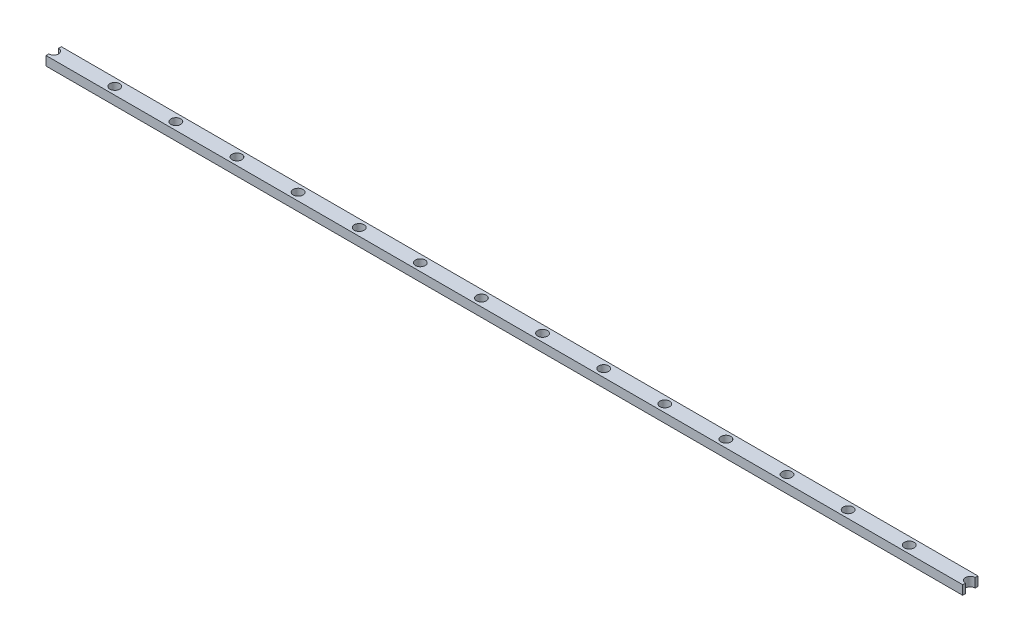
ISO-10303-21;
HEADER;
FILE_DESCRIPTION(('STEP AP214'),'2;1');
FILE_NAME('part.step','',(''),(''),'','','');
FILE_SCHEMA(('AUTOMOTIVE_DESIGN { 1 0 10303 214 1 1 1 1 }'));
ENDSEC;
DATA;
#1=APPLICATION_CONTEXT('core data for automotive mechanical design processes');
#2=APPLICATION_PROTOCOL_DEFINITION('international standard','automotive_design',2000,#1);
#3=PRODUCT_CONTEXT('',#1,'mechanical');
#4=PRODUCT('Part','Part','',(#3));
#5=PRODUCT_RELATED_PRODUCT_CATEGORY('part','',(#4));
#6=PRODUCT_DEFINITION_FORMATION('','',#4);
#7=PRODUCT_DEFINITION_CONTEXT('part definition',#1,'design');
#8=PRODUCT_DEFINITION('design','',#6,#7);
#9=PRODUCT_DEFINITION_SHAPE('','',#8);
#10=(LENGTH_UNIT() NAMED_UNIT(*) SI_UNIT(.MILLI.,.METRE.));
#11=(NAMED_UNIT(*) PLANE_ANGLE_UNIT() SI_UNIT($,.RADIAN.));
#12=(NAMED_UNIT(*) SI_UNIT($,.STERADIAN.) SOLID_ANGLE_UNIT());
#13=UNCERTAINTY_MEASURE_WITH_UNIT(LENGTH_MEASURE(1.E-05),#10,'distance_accuracy_value','');
#14=(GEOMETRIC_REPRESENTATION_CONTEXT(3) GLOBAL_UNCERTAINTY_ASSIGNED_CONTEXT((#13)) GLOBAL_UNIT_ASSIGNED_CONTEXT((#10,
#11,#12)) REPRESENTATION_CONTEXT('',''));
#15=CARTESIAN_POINT('',(0.,0.,0.));
#16=DIRECTION('',(0.,0.,1.));
#17=DIRECTION('',(1.,0.,0.));
#18=AXIS2_PLACEMENT_3D('',#15,#16,#17);
#19=CARTESIAN_POINT('',(0.,3.,0.));
#20=DIRECTION('',(1.,0.,0.));
#21=DIRECTION('',(0.,0.,-1.));
#22=AXIS2_PLACEMENT_3D('',#19,#20,#21);
#23=PLANE('',#22);
#24=DIRECTION('',(0.,0.,1.));
#25=VECTOR('',#24,1.);
#26=CARTESIAN_POINT('',(0.,0.,0.));
#27=LINE('',#26,#25);
#28=CARTESIAN_POINT('',(0.,0.,0.));
#29=VERTEX_POINT('',#28);
#30=CARTESIAN_POINT('',(0.,0.,0.9));
#31=VERTEX_POINT('',#30);
#32=EDGE_CURVE('E119',#29,#31,#27,.T.);
#33=ORIENTED_EDGE('',*,*,#32,.T.);
#34=DIRECTION('',(0.,1.,0.));
#35=VECTOR('',#34,1.);
#36=CARTESIAN_POINT('',(0.,0.,0.9));
#37=LINE('',#36,#35);
#38=CARTESIAN_POINT('',(0.,3.,0.9));
#39=VERTEX_POINT('',#38);
#40=EDGE_CURVE('E55',#31,#39,#37,.T.);
#41=ORIENTED_EDGE('',*,*,#40,.T.);
#42=DIRECTION('',(0.,0.,1.));
#43=VECTOR('',#42,1.);
#44=CARTESIAN_POINT('',(0.,3.,0.));
#45=LINE('',#44,#43);
#46=CARTESIAN_POINT('',(0.,3.,0.));
#47=VERTEX_POINT('',#46);
#48=EDGE_CURVE('E253',#47,#39,#45,.T.);
#49=ORIENTED_EDGE('',*,*,#48,.F.);
#50=DIRECTION('',(0.,-1.,0.));
#51=VECTOR('',#50,1.);
#52=CARTESIAN_POINT('',(0.,3.,0.));
#53=LINE('',#52,#51);
#54=EDGE_CURVE('E125',#47,#29,#53,.T.);
#55=ORIENTED_EDGE('',*,*,#54,.T.);
#56=EDGE_LOOP('',(#33,#41,#49,#55));
#57=FACE_BOUND('',#56,.T.);
#58=ADVANCED_FACE('F33',(#57),#23,.F.);
#59=CARTESIAN_POINT('',(300.,3.,0.));
#60=DIRECTION('',(-1.,0.,0.));
#61=DIRECTION('',(0.,0.,1.));
#62=AXIS2_PLACEMENT_3D('',#59,#60,#61);
#63=PLANE('',#62);
#64=DIRECTION('',(0.,0.,-1.));
#65=VECTOR('',#64,1.);
#66=CARTESIAN_POINT('',(300.,0.,0.));
#67=LINE('',#66,#65);
#68=CARTESIAN_POINT('',(300.,0.,5.));
#69=VERTEX_POINT('',#68);
#70=CARTESIAN_POINT('',(300.,0.,4.10000000000002));
#71=VERTEX_POINT('',#70);
#72=EDGE_CURVE('E116',#69,#71,#67,.T.);
#73=ORIENTED_EDGE('',*,*,#72,.T.);
#74=DIRECTION('',(0.,1.,0.));
#75=VECTOR('',#74,1.);
#76=CARTESIAN_POINT('',(300.,0.,4.10000000000002));
#77=LINE('',#76,#75);
#78=CARTESIAN_POINT('',(300.,3.,4.10000000000002));
#79=VERTEX_POINT('',#78);
#80=EDGE_CURVE('E48',#71,#79,#77,.T.);
#81=ORIENTED_EDGE('',*,*,#80,.T.);
#82=DIRECTION('',(0.,0.,-1.));
#83=VECTOR('',#82,1.);
#84=CARTESIAN_POINT('',(300.,3.,0.));
#85=LINE('',#84,#83);
#86=CARTESIAN_POINT('',(300.,3.,5.));
#87=VERTEX_POINT('',#86);
#88=EDGE_CURVE('E150',#87,#79,#85,.T.);
#89=ORIENTED_EDGE('',*,*,#88,.F.);
#90=DIRECTION('',(0.,-1.,0.));
#91=VECTOR('',#90,1.);
#92=CARTESIAN_POINT('',(300.,3.,5.));
#93=LINE('',#92,#91);
#94=EDGE_CURVE('E131',#87,#69,#93,.T.);
#95=ORIENTED_EDGE('',*,*,#94,.T.);
#96=EDGE_LOOP('',(#73,#81,#89,#95));
#97=FACE_BOUND('',#96,.T.);
#98=ADVANCED_FACE('F147',(#97),#63,.F.);
#99=CARTESIAN_POINT('',(0.,3.,4.1));
#100=VERTEX_POINT('',#99);
#101=CARTESIAN_POINT('',(0.,3.,5.));
#102=VERTEX_POINT('',#101);
#103=EDGE_CURVE('E124',#100,#102,#45,.T.);
#104=ORIENTED_EDGE('',*,*,#103,.F.);
#105=DIRECTION('',(0.,1.,0.));
#106=VECTOR('',#105,1.);
#107=CARTESIAN_POINT('',(0.,0.,4.1));
#108=LINE('',#107,#106);
#109=CARTESIAN_POINT('',(0.,0.,4.1));
#110=VERTEX_POINT('',#109);
#111=EDGE_CURVE('E145',#100,#110,#108,.F.);
#112=ORIENTED_EDGE('',*,*,#111,.T.);
#113=CARTESIAN_POINT('',(0.,0.,5.));
#114=VERTEX_POINT('',#113);
#115=EDGE_CURVE('E144',#110,#114,#27,.T.);
#116=ORIENTED_EDGE('',*,*,#115,.T.);
#117=DIRECTION('',(0.,-1.,0.));
#118=VECTOR('',#117,1.);
#119=CARTESIAN_POINT('',(0.,3.,5.));
#120=LINE('',#119,#118);
#121=EDGE_CURVE('E41',#102,#114,#120,.T.);
#122=ORIENTED_EDGE('',*,*,#121,.F.);
#123=EDGE_LOOP('',(#104,#112,#116,#122));
#124=FACE_BOUND('',#123,.T.);
#125=ADVANCED_FACE('F35',(#124),#23,.F.);
#126=CARTESIAN_POINT('',(0.,3.,5.));
#127=DIRECTION('',(0.,0.,-1.));
#128=DIRECTION('',(-1.,0.,0.));
#129=AXIS2_PLACEMENT_3D('',#126,#127,#128);
#130=PLANE('',#129);
#131=DIRECTION('',(1.,0.,0.));
#132=VECTOR('',#131,1.);
#133=CARTESIAN_POINT('',(0.,0.,5.));
#134=LINE('',#133,#132);
#135=EDGE_CURVE('E117',#114,#69,#134,.T.);
#136=ORIENTED_EDGE('',*,*,#135,.T.);
#137=ORIENTED_EDGE('',*,*,#94,.F.);
#138=DIRECTION('',(1.,0.,0.));
#139=VECTOR('',#138,1.);
#140=CARTESIAN_POINT('',(0.,3.,5.));
#141=LINE('',#140,#139);
#142=EDGE_CURVE('E140',#102,#87,#141,.T.);
#143=ORIENTED_EDGE('',*,*,#142,.F.);
#144=ORIENTED_EDGE('',*,*,#121,.T.);
#145=EDGE_LOOP('',(#136,#137,#143,#144));
#146=FACE_BOUND('',#145,.T.);
#147=ADVANCED_FACE('F137',(#146),#130,.F.);
#148=CARTESIAN_POINT('',(300.,3.,0.899999999999982));
#149=VERTEX_POINT('',#148);
#150=CARTESIAN_POINT('',(300.,3.,0.));
#151=VERTEX_POINT('',#150);
#152=EDGE_CURVE('E108',#149,#151,#85,.T.);
#153=ORIENTED_EDGE('',*,*,#152,.F.);
#154=DIRECTION('',(0.,1.,0.));
#155=VECTOR('',#154,1.);
#156=CARTESIAN_POINT('',(300.,0.,0.899999999999982));
#157=LINE('',#156,#155);
#158=CARTESIAN_POINT('',(300.,0.,0.899999999999982));
#159=VERTEX_POINT('',#158);
#160=EDGE_CURVE('E96',#149,#159,#157,.F.);
#161=ORIENTED_EDGE('',*,*,#160,.T.);
#162=CARTESIAN_POINT('',(300.,0.,0.));
#163=VERTEX_POINT('',#162);
#164=EDGE_CURVE('E106',#159,#163,#67,.T.);
#165=ORIENTED_EDGE('',*,*,#164,.T.);
#166=DIRECTION('',(0.,-1.,0.));
#167=VECTOR('',#166,1.);
#168=CARTESIAN_POINT('',(300.,3.,0.));
#169=LINE('',#168,#167);
#170=EDGE_CURVE('E128',#151,#163,#169,.T.);
#171=ORIENTED_EDGE('',*,*,#170,.F.);
#172=EDGE_LOOP('',(#153,#161,#165,#171));
#173=FACE_BOUND('',#172,.T.);
#174=ADVANCED_FACE('F104',(#173),#63,.F.);
#175=CARTESIAN_POINT('',(0.,3.,0.));
#176=DIRECTION('',(0.,0.,1.));
#177=DIRECTION('',(1.,0.,0.));
#178=AXIS2_PLACEMENT_3D('',#175,#176,#177);
#179=PLANE('',#178);
#180=DIRECTION('',(-1.,0.,0.));
#181=VECTOR('',#180,1.);
#182=CARTESIAN_POINT('',(0.,0.,0.));
#183=LINE('',#182,#181);
#184=EDGE_CURVE('E115',#163,#29,#183,.T.);
#185=ORIENTED_EDGE('',*,*,#184,.T.);
#186=ORIENTED_EDGE('',*,*,#54,.F.);
#187=DIRECTION('',(-1.,0.,0.));
#188=VECTOR('',#187,1.);
#189=CARTESIAN_POINT('',(0.,3.,0.));
#190=LINE('',#189,#188);
#191=EDGE_CURVE('E129',#151,#47,#190,.T.);
#192=ORIENTED_EDGE('',*,*,#191,.F.);
#193=ORIENTED_EDGE('',*,*,#170,.T.);
#194=EDGE_LOOP('',(#185,#186,#192,#193));
#195=FACE_BOUND('',#194,.T.);
#196=ADVANCED_FACE('F279',(#195),#179,.F.);
#197=CARTESIAN_POINT('',(0.,3.,0.));
#198=DIRECTION('',(0.,1.,0.));
#199=DIRECTION('',(0.,0.,1.));
#200=AXIS2_PLACEMENT_3D('',#197,#198,#199);
#201=PLANE('',#200);
#202=CARTESIAN_POINT('',(0.,3.,2.5));
#203=DIRECTION('',(0.,1.,0.));
#204=DIRECTION('',(0.,0.,1.));
#205=AXIS2_PLACEMENT_3D('',#202,#203,#204);
#206=CIRCLE('',#205,1.6);
#207=EDGE_CURVE('E161',#100,#39,#206,.T.);
#208=ORIENTED_EDGE('',*,*,#207,.F.);
#209=ORIENTED_EDGE('',*,*,#103,.T.);
#210=ORIENTED_EDGE('',*,*,#142,.T.);
#211=ORIENTED_EDGE('',*,*,#88,.T.);
#212=CARTESIAN_POINT('',(300.,3.,2.5));
#213=DIRECTION('',(0.,1.,0.));
#214=DIRECTION('',(0.,0.,1.));
#215=AXIS2_PLACEMENT_3D('',#212,#213,#214);
#216=CIRCLE('',#215,1.60000000000002);
#217=EDGE_CURVE('E249',#149,#79,#216,.T.);
#218=ORIENTED_EDGE('',*,*,#217,.F.);
#219=ORIENTED_EDGE('',*,*,#152,.T.);
#220=ORIENTED_EDGE('',*,*,#191,.T.);
#221=ORIENTED_EDGE('',*,*,#48,.T.);
#222=EDGE_LOOP('',(#208,#209,#210,#211,#218,#219,#220,#221));
#223=FACE_BOUND('',#222,.T.);
#224=CARTESIAN_POINT('',(20.,3.,2.5));
#225=DIRECTION('',(0.,1.,0.));
#226=DIRECTION('',(0.,0.,1.));
#227=AXIS2_PLACEMENT_3D('',#224,#225,#226);
#228=CIRCLE('',#227,1.6);
#229=CARTESIAN_POINT('',(20.,3.,4.1));
#230=VERTEX_POINT('',#229);
#231=EDGE_CURVE('E168',#230,#230,#228,.T.);
#232=ORIENTED_EDGE('',*,*,#231,.F.);
#233=EDGE_LOOP('',(#232));
#234=FACE_BOUND('',#233,.T.);
#235=CARTESIAN_POINT('',(40.,3.,2.5));
#236=DIRECTION('',(0.,1.,0.));
#237=DIRECTION('',(0.,0.,1.));
#238=AXIS2_PLACEMENT_3D('',#235,#236,#237);
#239=CIRCLE('',#238,1.6);
#240=CARTESIAN_POINT('',(40.,3.,4.1));
#241=VERTEX_POINT('',#240);
#242=EDGE_CURVE('E174',#241,#241,#239,.T.);
#243=ORIENTED_EDGE('',*,*,#242,.F.);
#244=EDGE_LOOP('',(#243));
#245=FACE_BOUND('',#244,.T.);
#246=CARTESIAN_POINT('',(60.,3.,2.5));
#247=DIRECTION('',(0.,1.,0.));
#248=DIRECTION('',(0.,0.,1.));
#249=AXIS2_PLACEMENT_3D('',#246,#247,#248);
#250=CIRCLE('',#249,1.6);
#251=CARTESIAN_POINT('',(60.,3.,4.1));
#252=VERTEX_POINT('',#251);
#253=EDGE_CURVE('E180',#252,#252,#250,.T.);
#254=ORIENTED_EDGE('',*,*,#253,.F.);
#255=EDGE_LOOP('',(#254));
#256=FACE_BOUND('',#255,.T.);
#257=CARTESIAN_POINT('',(80.,3.,2.5));
#258=DIRECTION('',(0.,1.,0.));
#259=DIRECTION('',(0.,0.,1.));
#260=AXIS2_PLACEMENT_3D('',#257,#258,#259);
#261=CIRCLE('',#260,1.6);
#262=CARTESIAN_POINT('',(80.,3.,4.1));
#263=VERTEX_POINT('',#262);
#264=EDGE_CURVE('E186',#263,#263,#261,.T.);
#265=ORIENTED_EDGE('',*,*,#264,.F.);
#266=EDGE_LOOP('',(#265));
#267=FACE_BOUND('',#266,.T.);
#268=CARTESIAN_POINT('',(100.,3.,2.5));
#269=DIRECTION('',(0.,1.,0.));
#270=DIRECTION('',(0.,0.,1.));
#271=AXIS2_PLACEMENT_3D('',#268,#269,#270);
#272=CIRCLE('',#271,1.6);
#273=CARTESIAN_POINT('',(100.,3.,4.1));
#274=VERTEX_POINT('',#273);
#275=EDGE_CURVE('E192',#274,#274,#272,.T.);
#276=ORIENTED_EDGE('',*,*,#275,.F.);
#277=EDGE_LOOP('',(#276));
#278=FACE_BOUND('',#277,.T.);
#279=CARTESIAN_POINT('',(120.,3.,2.5));
#280=DIRECTION('',(0.,1.,0.));
#281=DIRECTION('',(0.,0.,1.));
#282=AXIS2_PLACEMENT_3D('',#279,#280,#281);
#283=CIRCLE('',#282,1.6);
#284=CARTESIAN_POINT('',(120.,3.,4.1));
#285=VERTEX_POINT('',#284);
#286=EDGE_CURVE('E198',#285,#285,#283,.T.);
#287=ORIENTED_EDGE('',*,*,#286,.F.);
#288=EDGE_LOOP('',(#287));
#289=FACE_BOUND('',#288,.T.);
#290=CARTESIAN_POINT('',(140.,3.,2.5));
#291=DIRECTION('',(0.,1.,0.));
#292=DIRECTION('',(0.,0.,1.));
#293=AXIS2_PLACEMENT_3D('',#290,#291,#292);
#294=CIRCLE('',#293,1.59999999999999);
#295=CARTESIAN_POINT('',(140.,3.,4.09999999999999));
#296=VERTEX_POINT('',#295);
#297=EDGE_CURVE('E204',#296,#296,#294,.T.);
#298=ORIENTED_EDGE('',*,*,#297,.F.);
#299=EDGE_LOOP('',(#298));
#300=FACE_BOUND('',#299,.T.);
#301=CARTESIAN_POINT('',(160.,3.,2.5));
#302=DIRECTION('',(0.,1.,0.));
#303=DIRECTION('',(0.,0.,1.));
#304=AXIS2_PLACEMENT_3D('',#301,#302,#303);
#305=CIRCLE('',#304,1.59999999999999);
#306=CARTESIAN_POINT('',(160.,3.,4.09999999999999));
#307=VERTEX_POINT('',#306);
#308=EDGE_CURVE('E210',#307,#307,#305,.T.);
#309=ORIENTED_EDGE('',*,*,#308,.F.);
#310=EDGE_LOOP('',(#309));
#311=FACE_BOUND('',#310,.T.);
#312=CARTESIAN_POINT('',(180.,3.,2.5));
#313=DIRECTION('',(0.,1.,0.));
#314=DIRECTION('',(0.,0.,1.));
#315=AXIS2_PLACEMENT_3D('',#312,#313,#314);
#316=CIRCLE('',#315,1.59999999999999);
#317=CARTESIAN_POINT('',(180.,3.,4.09999999999999));
#318=VERTEX_POINT('',#317);
#319=EDGE_CURVE('E216',#318,#318,#316,.T.);
#320=ORIENTED_EDGE('',*,*,#319,.F.);
#321=EDGE_LOOP('',(#320));
#322=FACE_BOUND('',#321,.T.);
#323=CARTESIAN_POINT('',(200.,3.,2.5));
#324=DIRECTION('',(0.,1.,0.));
#325=DIRECTION('',(0.,0.,1.));
#326=AXIS2_PLACEMENT_3D('',#323,#324,#325);
#327=CIRCLE('',#326,1.59999999999999);
#328=CARTESIAN_POINT('',(200.,3.,4.09999999999999));
#329=VERTEX_POINT('',#328);
#330=EDGE_CURVE('E222',#329,#329,#327,.T.);
#331=ORIENTED_EDGE('',*,*,#330,.F.);
#332=EDGE_LOOP('',(#331));
#333=FACE_BOUND('',#332,.T.);
#334=CARTESIAN_POINT('',(220.,3.,2.5));
#335=DIRECTION('',(0.,1.,0.));
#336=DIRECTION('',(0.,0.,1.));
#337=AXIS2_PLACEMENT_3D('',#334,#335,#336);
#338=CIRCLE('',#337,1.59999999999999);
#339=CARTESIAN_POINT('',(220.,3.,4.09999999999999));
#340=VERTEX_POINT('',#339);
#341=EDGE_CURVE('E228',#340,#340,#338,.T.);
#342=ORIENTED_EDGE('',*,*,#341,.F.);
#343=EDGE_LOOP('',(#342));
#344=FACE_BOUND('',#343,.T.);
#345=CARTESIAN_POINT('',(240.,3.,2.5));
#346=DIRECTION('',(0.,1.,0.));
#347=DIRECTION('',(0.,0.,1.));
#348=AXIS2_PLACEMENT_3D('',#345,#346,#347);
#349=CIRCLE('',#348,1.59999999999999);
#350=CARTESIAN_POINT('',(240.,3.,4.09999999999999));
#351=VERTEX_POINT('',#350);
#352=EDGE_CURVE('E234',#351,#351,#349,.T.);
#353=ORIENTED_EDGE('',*,*,#352,.F.);
#354=EDGE_LOOP('',(#353));
#355=FACE_BOUND('',#354,.T.);
#356=CARTESIAN_POINT('',(260.,3.,2.5));
#357=DIRECTION('',(0.,1.,0.));
#358=DIRECTION('',(0.,0.,1.));
#359=AXIS2_PLACEMENT_3D('',#356,#357,#358);
#360=CIRCLE('',#359,1.60000000000002);
#361=CARTESIAN_POINT('',(260.,3.,4.10000000000002));
#362=VERTEX_POINT('',#361);
#363=EDGE_CURVE('E240',#362,#362,#360,.T.);
#364=ORIENTED_EDGE('',*,*,#363,.F.);
#365=EDGE_LOOP('',(#364));
#366=FACE_BOUND('',#365,.T.);
#367=CARTESIAN_POINT('',(280.,3.,2.5));
#368=DIRECTION('',(0.,1.,0.));
#369=DIRECTION('',(0.,0.,1.));
#370=AXIS2_PLACEMENT_3D('',#367,#368,#369);
#371=CIRCLE('',#370,1.60000000000002);
#372=CARTESIAN_POINT('',(280.,3.,4.10000000000002));
#373=VERTEX_POINT('',#372);
#374=EDGE_CURVE('E246',#373,#373,#371,.T.);
#375=ORIENTED_EDGE('',*,*,#374,.F.);
#376=EDGE_LOOP('',(#375));
#377=FACE_BOUND('',#376,.T.);
#378=ADVANCED_FACE('F255',(#223,#234,#245,#256,#267,#278,#289,#300,#311,#322,#333,#344,#355,
#366,#377),#201,.T.);
#379=CARTESIAN_POINT('',(0.,0.,0.));
#380=DIRECTION('',(0.,1.,0.));
#381=DIRECTION('',(0.,0.,1.));
#382=AXIS2_PLACEMENT_3D('',#379,#380,#381);
#383=PLANE('',#382);
#384=CARTESIAN_POINT('',(20.,0.,2.5));
#385=DIRECTION('',(0.,1.,0.));
#386=DIRECTION('',(0.,0.,1.));
#387=AXIS2_PLACEMENT_3D('',#384,#385,#386);
#388=CIRCLE('',#387,1.6);
#389=CARTESIAN_POINT('',(20.,0.,4.1));
#390=VERTEX_POINT('',#389);
#391=EDGE_CURVE('E163',#390,#390,#388,.T.);
#392=ORIENTED_EDGE('',*,*,#391,.T.);
#393=EDGE_LOOP('',(#392));
#394=FACE_BOUND('',#393,.T.);
#395=CARTESIAN_POINT('',(40.,0.,2.5));
#396=DIRECTION('',(0.,1.,0.));
#397=DIRECTION('',(0.,0.,1.));
#398=AXIS2_PLACEMENT_3D('',#395,#396,#397);
#399=CIRCLE('',#398,1.6);
#400=CARTESIAN_POINT('',(40.,0.,4.1));
#401=VERTEX_POINT('',#400);
#402=EDGE_CURVE('E171',#401,#401,#399,.T.);
#403=ORIENTED_EDGE('',*,*,#402,.T.);
#404=EDGE_LOOP('',(#403));
#405=FACE_BOUND('',#404,.T.);
#406=CARTESIAN_POINT('',(60.,0.,2.5));
#407=DIRECTION('',(0.,1.,0.));
#408=DIRECTION('',(0.,0.,1.));
#409=AXIS2_PLACEMENT_3D('',#406,#407,#408);
#410=CIRCLE('',#409,1.6);
#411=CARTESIAN_POINT('',(60.,0.,4.1));
#412=VERTEX_POINT('',#411);
#413=EDGE_CURVE('E177',#412,#412,#410,.T.);
#414=ORIENTED_EDGE('',*,*,#413,.T.);
#415=EDGE_LOOP('',(#414));
#416=FACE_BOUND('',#415,.T.);
#417=CARTESIAN_POINT('',(80.,0.,2.5));
#418=DIRECTION('',(0.,1.,0.));
#419=DIRECTION('',(0.,0.,1.));
#420=AXIS2_PLACEMENT_3D('',#417,#418,#419);
#421=CIRCLE('',#420,1.6);
#422=CARTESIAN_POINT('',(80.,0.,4.1));
#423=VERTEX_POINT('',#422);
#424=EDGE_CURVE('E183',#423,#423,#421,.T.);
#425=ORIENTED_EDGE('',*,*,#424,.T.);
#426=EDGE_LOOP('',(#425));
#427=FACE_BOUND('',#426,.T.);
#428=CARTESIAN_POINT('',(100.,0.,2.5));
#429=DIRECTION('',(0.,1.,0.));
#430=DIRECTION('',(0.,0.,1.));
#431=AXIS2_PLACEMENT_3D('',#428,#429,#430);
#432=CIRCLE('',#431,1.6);
#433=CARTESIAN_POINT('',(100.,0.,4.1));
#434=VERTEX_POINT('',#433);
#435=EDGE_CURVE('E189',#434,#434,#432,.T.);
#436=ORIENTED_EDGE('',*,*,#435,.T.);
#437=EDGE_LOOP('',(#436));
#438=FACE_BOUND('',#437,.T.);
#439=CARTESIAN_POINT('',(120.,0.,2.5));
#440=DIRECTION('',(0.,1.,0.));
#441=DIRECTION('',(0.,0.,1.));
#442=AXIS2_PLACEMENT_3D('',#439,#440,#441);
#443=CIRCLE('',#442,1.6);
#444=CARTESIAN_POINT('',(120.,0.,4.1));
#445=VERTEX_POINT('',#444);
#446=EDGE_CURVE('E195',#445,#445,#443,.T.);
#447=ORIENTED_EDGE('',*,*,#446,.T.);
#448=EDGE_LOOP('',(#447));
#449=FACE_BOUND('',#448,.T.);
#450=CARTESIAN_POINT('',(140.,0.,2.5));
#451=DIRECTION('',(0.,1.,0.));
#452=DIRECTION('',(0.,0.,1.));
#453=AXIS2_PLACEMENT_3D('',#450,#451,#452);
#454=CIRCLE('',#453,1.59999999999999);
#455=CARTESIAN_POINT('',(140.,0.,4.09999999999999));
#456=VERTEX_POINT('',#455);
#457=EDGE_CURVE('E201',#456,#456,#454,.T.);
#458=ORIENTED_EDGE('',*,*,#457,.T.);
#459=EDGE_LOOP('',(#458));
#460=FACE_BOUND('',#459,.T.);
#461=CARTESIAN_POINT('',(160.,0.,2.5));
#462=DIRECTION('',(0.,1.,0.));
#463=DIRECTION('',(0.,0.,1.));
#464=AXIS2_PLACEMENT_3D('',#461,#462,#463);
#465=CIRCLE('',#464,1.59999999999999);
#466=CARTESIAN_POINT('',(160.,0.,4.09999999999999));
#467=VERTEX_POINT('',#466);
#468=EDGE_CURVE('E207',#467,#467,#465,.T.);
#469=ORIENTED_EDGE('',*,*,#468,.T.);
#470=EDGE_LOOP('',(#469));
#471=FACE_BOUND('',#470,.T.);
#472=CARTESIAN_POINT('',(180.,0.,2.5));
#473=DIRECTION('',(0.,1.,0.));
#474=DIRECTION('',(0.,0.,1.));
#475=AXIS2_PLACEMENT_3D('',#472,#473,#474);
#476=CIRCLE('',#475,1.59999999999999);
#477=CARTESIAN_POINT('',(180.,0.,4.09999999999999));
#478=VERTEX_POINT('',#477);
#479=EDGE_CURVE('E213',#478,#478,#476,.T.);
#480=ORIENTED_EDGE('',*,*,#479,.T.);
#481=EDGE_LOOP('',(#480));
#482=FACE_BOUND('',#481,.T.);
#483=CARTESIAN_POINT('',(200.,0.,2.5));
#484=DIRECTION('',(0.,1.,0.));
#485=DIRECTION('',(0.,0.,1.));
#486=AXIS2_PLACEMENT_3D('',#483,#484,#485);
#487=CIRCLE('',#486,1.59999999999999);
#488=CARTESIAN_POINT('',(200.,0.,4.09999999999999));
#489=VERTEX_POINT('',#488);
#490=EDGE_CURVE('E219',#489,#489,#487,.T.);
#491=ORIENTED_EDGE('',*,*,#490,.T.);
#492=EDGE_LOOP('',(#491));
#493=FACE_BOUND('',#492,.T.);
#494=CARTESIAN_POINT('',(220.,0.,2.5));
#495=DIRECTION('',(0.,1.,0.));
#496=DIRECTION('',(0.,0.,1.));
#497=AXIS2_PLACEMENT_3D('',#494,#495,#496);
#498=CIRCLE('',#497,1.59999999999999);
#499=CARTESIAN_POINT('',(220.,0.,4.09999999999999));
#500=VERTEX_POINT('',#499);
#501=EDGE_CURVE('E225',#500,#500,#498,.T.);
#502=ORIENTED_EDGE('',*,*,#501,.T.);
#503=EDGE_LOOP('',(#502));
#504=FACE_BOUND('',#503,.T.);
#505=CARTESIAN_POINT('',(240.,0.,2.5));
#506=DIRECTION('',(0.,1.,0.));
#507=DIRECTION('',(0.,0.,1.));
#508=AXIS2_PLACEMENT_3D('',#505,#506,#507);
#509=CIRCLE('',#508,1.59999999999999);
#510=CARTESIAN_POINT('',(240.,0.,4.09999999999999));
#511=VERTEX_POINT('',#510);
#512=EDGE_CURVE('E231',#511,#511,#509,.T.);
#513=ORIENTED_EDGE('',*,*,#512,.T.);
#514=EDGE_LOOP('',(#513));
#515=FACE_BOUND('',#514,.T.);
#516=CARTESIAN_POINT('',(260.,0.,2.5));
#517=DIRECTION('',(0.,1.,0.));
#518=DIRECTION('',(0.,0.,1.));
#519=AXIS2_PLACEMENT_3D('',#516,#517,#518);
#520=CIRCLE('',#519,1.60000000000002);
#521=CARTESIAN_POINT('',(260.,0.,4.10000000000002));
#522=VERTEX_POINT('',#521);
#523=EDGE_CURVE('E237',#522,#522,#520,.T.);
#524=ORIENTED_EDGE('',*,*,#523,.T.);
#525=EDGE_LOOP('',(#524));
#526=FACE_BOUND('',#525,.T.);
#527=CARTESIAN_POINT('',(280.,0.,2.5));
#528=DIRECTION('',(0.,1.,0.));
#529=DIRECTION('',(0.,0.,1.));
#530=AXIS2_PLACEMENT_3D('',#527,#528,#529);
#531=CIRCLE('',#530,1.60000000000002);
#532=CARTESIAN_POINT('',(280.,0.,4.10000000000002));
#533=VERTEX_POINT('',#532);
#534=EDGE_CURVE('E243',#533,#533,#531,.T.);
#535=ORIENTED_EDGE('',*,*,#534,.T.);
#536=EDGE_LOOP('',(#535));
#537=FACE_BOUND('',#536,.T.);
#538=ORIENTED_EDGE('',*,*,#115,.F.);
#539=CARTESIAN_POINT('',(0.,0.,2.5));
#540=DIRECTION('',(0.,1.,0.));
#541=DIRECTION('',(0.,0.,1.));
#542=AXIS2_PLACEMENT_3D('',#539,#540,#541);
#543=CIRCLE('',#542,1.6);
#544=EDGE_CURVE('E109',#110,#31,#543,.T.);
#545=ORIENTED_EDGE('',*,*,#544,.T.);
#546=ORIENTED_EDGE('',*,*,#32,.F.);
#547=ORIENTED_EDGE('',*,*,#184,.F.);
#548=ORIENTED_EDGE('',*,*,#164,.F.);
#549=CARTESIAN_POINT('',(300.,0.,2.5));
#550=DIRECTION('',(0.,1.,0.));
#551=DIRECTION('',(0.,0.,1.));
#552=AXIS2_PLACEMENT_3D('',#549,#550,#551);
#553=CIRCLE('',#552,1.60000000000002);
#554=EDGE_CURVE('E11',#159,#71,#553,.T.);
#555=ORIENTED_EDGE('',*,*,#554,.T.);
#556=ORIENTED_EDGE('',*,*,#72,.F.);
#557=ORIENTED_EDGE('',*,*,#135,.F.);
#558=EDGE_LOOP('',(#538,#545,#546,#547,#548,#555,#556,#557));
#559=FACE_BOUND('',#558,.T.);
#560=ADVANCED_FACE('F113',(#394,#405,#416,#427,#438,#449,#460,#471,#482,#493,#504,#515,#526,
#537,#559),#383,.F.);
#561=CARTESIAN_POINT('',(300.,0.,2.5));
#562=DIRECTION('',(0.,1.,0.));
#563=DIRECTION('',(0.,0.,1.));
#564=AXIS2_PLACEMENT_3D('',#561,#562,#563);
#565=CYLINDRICAL_SURFACE('',#564,1.60000000000002);
#566=ORIENTED_EDGE('',*,*,#554,.F.);
#567=ORIENTED_EDGE('',*,*,#160,.F.);
#568=ORIENTED_EDGE('',*,*,#217,.T.);
#569=ORIENTED_EDGE('',*,*,#80,.F.);
#570=EDGE_LOOP('',(#566,#567,#568,#569));
#571=FACE_BOUND('',#570,.T.);
#572=ADVANCED_FACE('F95',(#571),#565,.F.);
#573=CARTESIAN_POINT('',(280.,0.,2.5));
#574=DIRECTION('',(0.,1.,0.));
#575=DIRECTION('',(0.,0.,1.));
#576=AXIS2_PLACEMENT_3D('',#573,#574,#575);
#577=CYLINDRICAL_SURFACE('',#576,1.60000000000002);
#578=ORIENTED_EDGE('',*,*,#534,.F.);
#579=EDGE_LOOP('',(#578));
#580=FACE_BOUND('',#579,.T.);
#581=ORIENTED_EDGE('',*,*,#374,.T.);
#582=EDGE_LOOP('',(#581));
#583=FACE_BOUND('',#582,.T.);
#584=ADVANCED_FACE('F291',(#580,#583),#577,.F.);
#585=CARTESIAN_POINT('',(260.,0.,2.5));
#586=DIRECTION('',(0.,1.,0.));
#587=DIRECTION('',(0.,0.,1.));
#588=AXIS2_PLACEMENT_3D('',#585,#586,#587);
#589=CYLINDRICAL_SURFACE('',#588,1.60000000000002);
#590=ORIENTED_EDGE('',*,*,#523,.F.);
#591=EDGE_LOOP('',(#590));
#592=FACE_BOUND('',#591,.T.);
#593=ORIENTED_EDGE('',*,*,#363,.T.);
#594=EDGE_LOOP('',(#593));
#595=FACE_BOUND('',#594,.T.);
#596=ADVANCED_FACE('F294',(#592,#595),#589,.F.);
#597=CARTESIAN_POINT('',(240.,0.,2.5));
#598=DIRECTION('',(0.,1.,0.));
#599=DIRECTION('',(0.,0.,1.));
#600=AXIS2_PLACEMENT_3D('',#597,#598,#599);
#601=CYLINDRICAL_SURFACE('',#600,1.59999999999999);
#602=ORIENTED_EDGE('',*,*,#512,.F.);
#603=EDGE_LOOP('',(#602));
#604=FACE_BOUND('',#603,.T.);
#605=ORIENTED_EDGE('',*,*,#352,.T.);
#606=EDGE_LOOP('',(#605));
#607=FACE_BOUND('',#606,.T.);
#608=ADVANCED_FACE('F298',(#604,#607),#601,.F.);
#609=CARTESIAN_POINT('',(220.,0.,2.5));
#610=DIRECTION('',(0.,1.,0.));
#611=DIRECTION('',(0.,0.,1.));
#612=AXIS2_PLACEMENT_3D('',#609,#610,#611);
#613=CYLINDRICAL_SURFACE('',#612,1.59999999999999);
#614=ORIENTED_EDGE('',*,*,#501,.F.);
#615=EDGE_LOOP('',(#614));
#616=FACE_BOUND('',#615,.T.);
#617=ORIENTED_EDGE('',*,*,#341,.T.);
#618=EDGE_LOOP('',(#617));
#619=FACE_BOUND('',#618,.T.);
#620=ADVANCED_FACE('F302',(#616,#619),#613,.F.);
#621=CARTESIAN_POINT('',(200.,0.,2.5));
#622=DIRECTION('',(0.,1.,0.));
#623=DIRECTION('',(0.,0.,1.));
#624=AXIS2_PLACEMENT_3D('',#621,#622,#623);
#625=CYLINDRICAL_SURFACE('',#624,1.59999999999999);
#626=ORIENTED_EDGE('',*,*,#490,.F.);
#627=EDGE_LOOP('',(#626));
#628=FACE_BOUND('',#627,.T.);
#629=ORIENTED_EDGE('',*,*,#330,.T.);
#630=EDGE_LOOP('',(#629));
#631=FACE_BOUND('',#630,.T.);
#632=ADVANCED_FACE('F306',(#628,#631),#625,.F.);
#633=CARTESIAN_POINT('',(180.,0.,2.5));
#634=DIRECTION('',(0.,1.,0.));
#635=DIRECTION('',(0.,0.,1.));
#636=AXIS2_PLACEMENT_3D('',#633,#634,#635);
#637=CYLINDRICAL_SURFACE('',#636,1.59999999999999);
#638=ORIENTED_EDGE('',*,*,#479,.F.);
#639=EDGE_LOOP('',(#638));
#640=FACE_BOUND('',#639,.T.);
#641=ORIENTED_EDGE('',*,*,#319,.T.);
#642=EDGE_LOOP('',(#641));
#643=FACE_BOUND('',#642,.T.);
#644=ADVANCED_FACE('F310',(#640,#643),#637,.F.);
#645=CARTESIAN_POINT('',(160.,0.,2.5));
#646=DIRECTION('',(0.,1.,0.));
#647=DIRECTION('',(0.,0.,1.));
#648=AXIS2_PLACEMENT_3D('',#645,#646,#647);
#649=CYLINDRICAL_SURFACE('',#648,1.59999999999999);
#650=ORIENTED_EDGE('',*,*,#468,.F.);
#651=EDGE_LOOP('',(#650));
#652=FACE_BOUND('',#651,.T.);
#653=ORIENTED_EDGE('',*,*,#308,.T.);
#654=EDGE_LOOP('',(#653));
#655=FACE_BOUND('',#654,.T.);
#656=ADVANCED_FACE('F314',(#652,#655),#649,.F.);
#657=CARTESIAN_POINT('',(140.,0.,2.5));
#658=DIRECTION('',(0.,1.,0.));
#659=DIRECTION('',(0.,0.,1.));
#660=AXIS2_PLACEMENT_3D('',#657,#658,#659);
#661=CYLINDRICAL_SURFACE('',#660,1.59999999999999);
#662=ORIENTED_EDGE('',*,*,#457,.F.);
#663=EDGE_LOOP('',(#662));
#664=FACE_BOUND('',#663,.T.);
#665=ORIENTED_EDGE('',*,*,#297,.T.);
#666=EDGE_LOOP('',(#665));
#667=FACE_BOUND('',#666,.T.);
#668=ADVANCED_FACE('F318',(#664,#667),#661,.F.);
#669=CARTESIAN_POINT('',(120.,0.,2.5));
#670=DIRECTION('',(0.,1.,0.));
#671=DIRECTION('',(0.,0.,1.));
#672=AXIS2_PLACEMENT_3D('',#669,#670,#671);
#673=CYLINDRICAL_SURFACE('',#672,1.6);
#674=ORIENTED_EDGE('',*,*,#446,.F.);
#675=EDGE_LOOP('',(#674));
#676=FACE_BOUND('',#675,.T.);
#677=ORIENTED_EDGE('',*,*,#286,.T.);
#678=EDGE_LOOP('',(#677));
#679=FACE_BOUND('',#678,.T.);
#680=ADVANCED_FACE('F322',(#676,#679),#673,.F.);
#681=CARTESIAN_POINT('',(100.,0.,2.5));
#682=DIRECTION('',(0.,1.,0.));
#683=DIRECTION('',(0.,0.,1.));
#684=AXIS2_PLACEMENT_3D('',#681,#682,#683);
#685=CYLINDRICAL_SURFACE('',#684,1.6);
#686=ORIENTED_EDGE('',*,*,#435,.F.);
#687=EDGE_LOOP('',(#686));
#688=FACE_BOUND('',#687,.T.);
#689=ORIENTED_EDGE('',*,*,#275,.T.);
#690=EDGE_LOOP('',(#689));
#691=FACE_BOUND('',#690,.T.);
#692=ADVANCED_FACE('F326',(#688,#691),#685,.F.);
#693=CARTESIAN_POINT('',(80.,0.,2.5));
#694=DIRECTION('',(0.,1.,0.));
#695=DIRECTION('',(0.,0.,1.));
#696=AXIS2_PLACEMENT_3D('',#693,#694,#695);
#697=CYLINDRICAL_SURFACE('',#696,1.6);
#698=ORIENTED_EDGE('',*,*,#424,.F.);
#699=EDGE_LOOP('',(#698));
#700=FACE_BOUND('',#699,.T.);
#701=ORIENTED_EDGE('',*,*,#264,.T.);
#702=EDGE_LOOP('',(#701));
#703=FACE_BOUND('',#702,.T.);
#704=ADVANCED_FACE('F330',(#700,#703),#697,.F.);
#705=CARTESIAN_POINT('',(60.,0.,2.5));
#706=DIRECTION('',(0.,1.,0.));
#707=DIRECTION('',(0.,0.,1.));
#708=AXIS2_PLACEMENT_3D('',#705,#706,#707);
#709=CYLINDRICAL_SURFACE('',#708,1.6);
#710=ORIENTED_EDGE('',*,*,#413,.F.);
#711=EDGE_LOOP('',(#710));
#712=FACE_BOUND('',#711,.T.);
#713=ORIENTED_EDGE('',*,*,#253,.T.);
#714=EDGE_LOOP('',(#713));
#715=FACE_BOUND('',#714,.T.);
#716=ADVANCED_FACE('F334',(#712,#715),#709,.F.);
#717=CARTESIAN_POINT('',(40.,0.,2.5));
#718=DIRECTION('',(0.,1.,0.));
#719=DIRECTION('',(0.,0.,1.));
#720=AXIS2_PLACEMENT_3D('',#717,#718,#719);
#721=CYLINDRICAL_SURFACE('',#720,1.6);
#722=ORIENTED_EDGE('',*,*,#402,.F.);
#723=EDGE_LOOP('',(#722));
#724=FACE_BOUND('',#723,.T.);
#725=ORIENTED_EDGE('',*,*,#242,.T.);
#726=EDGE_LOOP('',(#725));
#727=FACE_BOUND('',#726,.T.);
#728=ADVANCED_FACE('F264',(#724,#727),#721,.F.);
#729=CARTESIAN_POINT('',(20.,0.,2.5));
#730=DIRECTION('',(0.,1.,0.));
#731=DIRECTION('',(0.,0.,1.));
#732=AXIS2_PLACEMENT_3D('',#729,#730,#731);
#733=CYLINDRICAL_SURFACE('',#732,1.6);
#734=ORIENTED_EDGE('',*,*,#391,.F.);
#735=EDGE_LOOP('',(#734));
#736=FACE_BOUND('',#735,.T.);
#737=ORIENTED_EDGE('',*,*,#231,.T.);
#738=EDGE_LOOP('',(#737));
#739=FACE_BOUND('',#738,.T.);
#740=ADVANCED_FACE('F259',(#736,#739),#733,.F.);
#741=CARTESIAN_POINT('',(0.,0.,2.5));
#742=DIRECTION('',(0.,1.,0.));
#743=DIRECTION('',(0.,0.,1.));
#744=AXIS2_PLACEMENT_3D('',#741,#742,#743);
#745=CYLINDRICAL_SURFACE('',#744,1.6);
#746=ORIENTED_EDGE('',*,*,#544,.F.);
#747=ORIENTED_EDGE('',*,*,#111,.F.);
#748=ORIENTED_EDGE('',*,*,#207,.T.);
#749=ORIENTED_EDGE('',*,*,#40,.F.);
#750=EDGE_LOOP('',(#746,#747,#748,#749));
#751=FACE_BOUND('',#750,.T.);
#752=ADVANCED_FACE('F257',(#751),#745,.F.);
#753=CLOSED_SHELL('',(#58,#98,#125,#147,#174,#196,#378,#560,#572,#584,#596,#608,#620,#632,#644,
#656,#668,#680,#692,#704,#716,#728,#740,#752));
#754=MANIFOLD_SOLID_BREP('B2',#753);
#755=ADVANCED_BREP_SHAPE_REPRESENTATION('',(#18,#754),#14);
#756=SHAPE_DEFINITION_REPRESENTATION(#9,#755);
ENDSEC;
END-ISO-10303-21;
